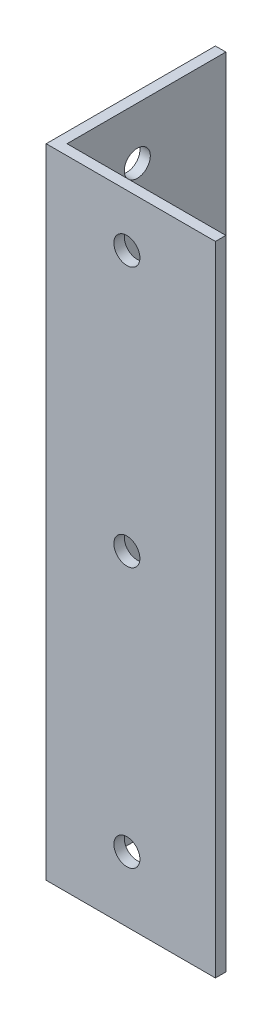
ISO-10303-21;
HEADER;
FILE_DESCRIPTION(('STEP AP214'),'2;1');
FILE_NAME('part.step','',(''),(''),'','','');
FILE_SCHEMA(('AUTOMOTIVE_DESIGN { 1 0 10303 214 1 1 1 1 }'));
ENDSEC;
DATA;
#1=APPLICATION_CONTEXT('core data for automotive mechanical design processes');
#2=APPLICATION_PROTOCOL_DEFINITION('international standard','automotive_design',2000,#1);
#3=PRODUCT_CONTEXT('',#1,'mechanical');
#4=PRODUCT('Part','Part','',(#3));
#5=PRODUCT_RELATED_PRODUCT_CATEGORY('part','',(#4));
#6=PRODUCT_DEFINITION_FORMATION('','',#4);
#7=PRODUCT_DEFINITION_CONTEXT('part definition',#1,'design');
#8=PRODUCT_DEFINITION('design','',#6,#7);
#9=PRODUCT_DEFINITION_SHAPE('','',#8);
#10=(LENGTH_UNIT() NAMED_UNIT(*) SI_UNIT(.MILLI.,.METRE.));
#11=(NAMED_UNIT(*) PLANE_ANGLE_UNIT() SI_UNIT($,.RADIAN.));
#12=(NAMED_UNIT(*) SI_UNIT($,.STERADIAN.) SOLID_ANGLE_UNIT());
#13=UNCERTAINTY_MEASURE_WITH_UNIT(LENGTH_MEASURE(1.E-05),#10,'distance_accuracy_value','');
#14=(GEOMETRIC_REPRESENTATION_CONTEXT(3) GLOBAL_UNCERTAINTY_ASSIGNED_CONTEXT((#13)) GLOBAL_UNIT_ASSIGNED_CONTEXT((#10,
#11,#12)) REPRESENTATION_CONTEXT('',''));
#15=CARTESIAN_POINT('',(0.,0.,0.));
#16=DIRECTION('',(0.,0.,1.));
#17=DIRECTION('',(1.,0.,0.));
#18=AXIS2_PLACEMENT_3D('',#15,#16,#17);
#19=CARTESIAN_POINT('',(4.,245.,0.));
#20=DIRECTION('',(-1.,0.,0.));
#21=DIRECTION('',(0.,0.,1.));
#22=AXIS2_PLACEMENT_3D('',#19,#20,#21);
#23=PLANE('',#22);
#24=CARTESIAN_POINT('',(4.,125.,-30.9999999999961));
#25=DIRECTION('',(-1.,0.,0.));
#26=DIRECTION('',(0.,0.,1.));
#27=AXIS2_PLACEMENT_3D('',#24,#25,#26);
#28=CIRCLE('',#27,4.99999999999999);
#29=CARTESIAN_POINT('',(4.,125.,-25.9999999999961));
#30=VERTEX_POINT('',#29);
#31=EDGE_CURVE('E223',#30,#30,#28,.T.);
#32=ORIENTED_EDGE('',*,*,#31,.T.);
#33=EDGE_LOOP('',(#32));
#34=FACE_BOUND('',#33,.T.);
#35=CARTESIAN_POINT('',(4.,25.,-30.9999999999922));
#36=DIRECTION('',(-1.,0.,0.));
#37=DIRECTION('',(0.,0.,1.));
#38=AXIS2_PLACEMENT_3D('',#35,#36,#37);
#39=CIRCLE('',#38,5.);
#40=CARTESIAN_POINT('',(4.,25.,-25.9999999999922));
#41=VERTEX_POINT('',#40);
#42=EDGE_CURVE('E225',#41,#41,#39,.T.);
#43=ORIENTED_EDGE('',*,*,#42,.T.);
#44=EDGE_LOOP('',(#43));
#45=FACE_BOUND('',#44,.T.);
#46=CARTESIAN_POINT('',(4.,225.,-31.));
#47=DIRECTION('',(-1.,0.,0.));
#48=DIRECTION('',(0.,0.,1.));
#49=AXIS2_PLACEMENT_3D('',#46,#47,#48);
#50=CIRCLE('',#49,5.);
#51=CARTESIAN_POINT('',(4.,225.,-26.));
#52=VERTEX_POINT('',#51);
#53=EDGE_CURVE('E142',#52,#52,#50,.T.);
#54=ORIENTED_EDGE('',*,*,#53,.T.);
#55=EDGE_LOOP('',(#54));
#56=FACE_BOUND('',#55,.T.);
#57=DIRECTION('',(0.,0.,-1.));
#58=VECTOR('',#57,1.);
#59=CARTESIAN_POINT('',(4.,0.,0.));
#60=LINE('',#59,#58);
#61=CARTESIAN_POINT('',(4.,0.,-4.));
#62=VERTEX_POINT('',#61);
#63=CARTESIAN_POINT('',(4.,0.,-65.));
#64=VERTEX_POINT('',#63);
#65=EDGE_CURVE('E128',#62,#64,#60,.T.);
#66=ORIENTED_EDGE('',*,*,#65,.T.);
#67=DIRECTION('',(0.,-1.,0.));
#68=VECTOR('',#67,1.);
#69=CARTESIAN_POINT('',(4.,245.,-65.));
#70=LINE('',#69,#68);
#71=CARTESIAN_POINT('',(4.,245.,-65.));
#72=VERTEX_POINT('',#71);
#73=EDGE_CURVE('E11',#72,#64,#70,.T.);
#74=ORIENTED_EDGE('',*,*,#73,.F.);
#75=DIRECTION('',(0.,0.,-1.));
#76=VECTOR('',#75,1.);
#77=CARTESIAN_POINT('',(4.,245.,0.));
#78=LINE('',#77,#76);
#79=CARTESIAN_POINT('',(4.,245.,-4.));
#80=VERTEX_POINT('',#79);
#81=EDGE_CURVE('E149',#80,#72,#78,.T.);
#82=ORIENTED_EDGE('',*,*,#81,.F.);
#83=DIRECTION('',(0.,-1.,0.));
#84=VECTOR('',#83,1.);
#85=CARTESIAN_POINT('',(4.,245.,-4.));
#86=LINE('',#85,#84);
#87=EDGE_CURVE('E120',#80,#62,#86,.T.);
#88=ORIENTED_EDGE('',*,*,#87,.T.);
#89=EDGE_LOOP('',(#66,#74,#82,#88));
#90=FACE_BOUND('',#89,.T.);
#91=ADVANCED_FACE('F37',(#34,#45,#56,#90),#23,.F.);
#92=CARTESIAN_POINT('',(0.,245.,-65.));
#93=DIRECTION('',(0.,0.,-1.));
#94=DIRECTION('',(-1.,0.,0.));
#95=AXIS2_PLACEMENT_3D('',#92,#93,#94);
#96=PLANE('',#95);
#97=DIRECTION('',(1.,0.,0.));
#98=VECTOR('',#97,1.);
#99=CARTESIAN_POINT('',(0.,0.,-65.));
#100=LINE('',#99,#98);
#101=CARTESIAN_POINT('',(0.,0.,-65.));
#102=VERTEX_POINT('',#101);
#103=EDGE_CURVE('E156',#102,#64,#100,.T.);
#104=ORIENTED_EDGE('',*,*,#103,.F.);
#105=DIRECTION('',(0.,-1.,0.));
#106=VECTOR('',#105,1.);
#107=CARTESIAN_POINT('',(0.,245.,-65.));
#108=LINE('',#107,#106);
#109=CARTESIAN_POINT('',(0.,245.,-65.));
#110=VERTEX_POINT('',#109);
#111=EDGE_CURVE('E46',#110,#102,#108,.T.);
#112=ORIENTED_EDGE('',*,*,#111,.F.);
#113=DIRECTION('',(1.,0.,0.));
#114=VECTOR('',#113,1.);
#115=CARTESIAN_POINT('',(0.,245.,-65.));
#116=LINE('',#115,#114);
#117=EDGE_CURVE('E88',#110,#72,#116,.T.);
#118=ORIENTED_EDGE('',*,*,#117,.T.);
#119=ORIENTED_EDGE('',*,*,#73,.T.);
#120=EDGE_LOOP('',(#104,#112,#118,#119));
#121=FACE_BOUND('',#120,.T.);
#122=ADVANCED_FACE('F169',(#121),#96,.T.);
#123=CARTESIAN_POINT('',(0.,245.,0.));
#124=DIRECTION('',(-1.,0.,0.));
#125=DIRECTION('',(0.,0.,1.));
#126=AXIS2_PLACEMENT_3D('',#123,#124,#125);
#127=PLANE('',#126);
#128=CARTESIAN_POINT('',(0.,125.,-30.9999999999961));
#129=DIRECTION('',(-1.,0.,0.));
#130=DIRECTION('',(0.,0.,1.));
#131=AXIS2_PLACEMENT_3D('',#128,#129,#130);
#132=CIRCLE('',#131,4.99999999999999);
#133=CARTESIAN_POINT('',(0.,125.,-25.9999999999961));
#134=VERTEX_POINT('',#133);
#135=EDGE_CURVE('E220',#134,#134,#132,.T.);
#136=ORIENTED_EDGE('',*,*,#135,.F.);
#137=EDGE_LOOP('',(#136));
#138=FACE_BOUND('',#137,.T.);
#139=CARTESIAN_POINT('',(0.,25.,-30.9999999999922));
#140=DIRECTION('',(-1.,0.,0.));
#141=DIRECTION('',(0.,0.,1.));
#142=AXIS2_PLACEMENT_3D('',#139,#140,#141);
#143=CIRCLE('',#142,5.);
#144=CARTESIAN_POINT('',(0.,25.,-25.9999999999922));
#145=VERTEX_POINT('',#144);
#146=EDGE_CURVE('E231',#145,#145,#143,.T.);
#147=ORIENTED_EDGE('',*,*,#146,.F.);
#148=EDGE_LOOP('',(#147));
#149=FACE_BOUND('',#148,.T.);
#150=CARTESIAN_POINT('',(0.,225.,-31.));
#151=DIRECTION('',(-1.,0.,0.));
#152=DIRECTION('',(0.,0.,1.));
#153=AXIS2_PLACEMENT_3D('',#150,#151,#152);
#154=CIRCLE('',#153,5.);
#155=CARTESIAN_POINT('',(0.,225.,-26.));
#156=VERTEX_POINT('',#155);
#157=EDGE_CURVE('E224',#156,#156,#154,.T.);
#158=ORIENTED_EDGE('',*,*,#157,.F.);
#159=EDGE_LOOP('',(#158));
#160=FACE_BOUND('',#159,.T.);
#161=DIRECTION('',(0.,0.,-1.));
#162=VECTOR('',#161,1.);
#163=CARTESIAN_POINT('',(0.,0.,0.));
#164=LINE('',#163,#162);
#165=CARTESIAN_POINT('',(0.,0.,0.));
#166=VERTEX_POINT('',#165);
#167=EDGE_CURVE('E158',#166,#102,#164,.T.);
#168=ORIENTED_EDGE('',*,*,#167,.F.);
#169=DIRECTION('',(0.,-1.,0.));
#170=VECTOR('',#169,1.);
#171=CARTESIAN_POINT('',(0.,245.,0.));
#172=LINE('',#171,#170);
#173=CARTESIAN_POINT('',(0.,245.,0.));
#174=VERTEX_POINT('',#173);
#175=EDGE_CURVE('E117',#174,#166,#172,.T.);
#176=ORIENTED_EDGE('',*,*,#175,.F.);
#177=DIRECTION('',(0.,0.,-1.));
#178=VECTOR('',#177,1.);
#179=CARTESIAN_POINT('',(0.,245.,0.));
#180=LINE('',#179,#178);
#181=EDGE_CURVE('E110',#174,#110,#180,.T.);
#182=ORIENTED_EDGE('',*,*,#181,.T.);
#183=ORIENTED_EDGE('',*,*,#111,.T.);
#184=EDGE_LOOP('',(#168,#176,#182,#183));
#185=FACE_BOUND('',#184,.T.);
#186=ADVANCED_FACE('F171',(#138,#149,#160,#185),#127,.T.);
#187=CARTESIAN_POINT('',(0.,245.,0.));
#188=DIRECTION('',(0.,0.,1.));
#189=DIRECTION('',(1.,0.,0.));
#190=AXIS2_PLACEMENT_3D('',#187,#188,#189);
#191=PLANE('',#190);
#192=CARTESIAN_POINT('',(31.0000000000039,125.,0.));
#193=DIRECTION('',(0.,0.,1.));
#194=DIRECTION('',(1.,0.,0.));
#195=AXIS2_PLACEMENT_3D('',#192,#193,#194);
#196=CIRCLE('',#195,5.00000000000001);
#197=CARTESIAN_POINT('',(36.0000000000039,125.,0.));
#198=VERTEX_POINT('',#197);
#199=EDGE_CURVE('E132',#198,#198,#196,.T.);
#200=ORIENTED_EDGE('',*,*,#199,.F.);
#201=EDGE_LOOP('',(#200));
#202=FACE_BOUND('',#201,.T.);
#203=CARTESIAN_POINT('',(31.0000000000078,25.,0.));
#204=DIRECTION('',(0.,0.,1.));
#205=DIRECTION('',(1.,0.,0.));
#206=AXIS2_PLACEMENT_3D('',#203,#204,#205);
#207=CIRCLE('',#206,5.);
#208=CARTESIAN_POINT('',(36.0000000000078,25.,0.));
#209=VERTEX_POINT('',#208);
#210=EDGE_CURVE('E137',#209,#209,#207,.T.);
#211=ORIENTED_EDGE('',*,*,#210,.F.);
#212=EDGE_LOOP('',(#211));
#213=FACE_BOUND('',#212,.T.);
#214=CARTESIAN_POINT('',(31.,225.,0.));
#215=DIRECTION('',(0.,0.,1.));
#216=DIRECTION('',(1.,0.,0.));
#217=AXIS2_PLACEMENT_3D('',#214,#215,#216);
#218=CIRCLE('',#217,5.);
#219=CARTESIAN_POINT('',(36.,225.,0.));
#220=VERTEX_POINT('',#219);
#221=EDGE_CURVE('E129',#220,#220,#218,.T.);
#222=ORIENTED_EDGE('',*,*,#221,.F.);
#223=EDGE_LOOP('',(#222));
#224=FACE_BOUND('',#223,.T.);
#225=DIRECTION('',(-1.,0.,0.));
#226=VECTOR('',#225,1.);
#227=CARTESIAN_POINT('',(0.,0.,0.));
#228=LINE('',#227,#226);
#229=CARTESIAN_POINT('',(65.,0.,0.));
#230=VERTEX_POINT('',#229);
#231=EDGE_CURVE('E116',#230,#166,#228,.T.);
#232=ORIENTED_EDGE('',*,*,#231,.F.);
#233=DIRECTION('',(0.,-1.,0.));
#234=VECTOR('',#233,1.);
#235=CARTESIAN_POINT('',(65.,245.,0.));
#236=LINE('',#235,#234);
#237=CARTESIAN_POINT('',(65.,245.,0.));
#238=VERTEX_POINT('',#237);
#239=EDGE_CURVE('E103',#238,#230,#236,.T.);
#240=ORIENTED_EDGE('',*,*,#239,.F.);
#241=DIRECTION('',(-1.,0.,0.));
#242=VECTOR('',#241,1.);
#243=CARTESIAN_POINT('',(0.,245.,0.));
#244=LINE('',#243,#242);
#245=EDGE_CURVE('E106',#238,#174,#244,.T.);
#246=ORIENTED_EDGE('',*,*,#245,.T.);
#247=ORIENTED_EDGE('',*,*,#175,.T.);
#248=EDGE_LOOP('',(#232,#240,#246,#247));
#249=FACE_BOUND('',#248,.T.);
#250=ADVANCED_FACE('F115',(#202,#213,#224,#249),#191,.T.);
#251=CARTESIAN_POINT('',(65.,245.,-4.));
#252=DIRECTION('',(1.,0.,0.));
#253=DIRECTION('',(0.,0.,-1.));
#254=AXIS2_PLACEMENT_3D('',#251,#252,#253);
#255=PLANE('',#254);
#256=DIRECTION('',(0.,0.,1.));
#257=VECTOR('',#256,1.);
#258=CARTESIAN_POINT('',(65.,0.,-4.));
#259=LINE('',#258,#257);
#260=CARTESIAN_POINT('',(65.,0.,-4.));
#261=VERTEX_POINT('',#260);
#262=EDGE_CURVE('E161',#261,#230,#259,.T.);
#263=ORIENTED_EDGE('',*,*,#262,.F.);
#264=DIRECTION('',(0.,-1.,0.));
#265=VECTOR('',#264,1.);
#266=CARTESIAN_POINT('',(65.,245.,-4.));
#267=LINE('',#266,#265);
#268=CARTESIAN_POINT('',(65.,245.,-4.));
#269=VERTEX_POINT('',#268);
#270=EDGE_CURVE('E105',#269,#261,#267,.T.);
#271=ORIENTED_EDGE('',*,*,#270,.F.);
#272=DIRECTION('',(0.,0.,1.));
#273=VECTOR('',#272,1.);
#274=CARTESIAN_POINT('',(65.,245.,-4.));
#275=LINE('',#274,#273);
#276=EDGE_CURVE('E98',#269,#238,#275,.T.);
#277=ORIENTED_EDGE('',*,*,#276,.T.);
#278=ORIENTED_EDGE('',*,*,#239,.T.);
#279=EDGE_LOOP('',(#263,#271,#277,#278));
#280=FACE_BOUND('',#279,.T.);
#281=ADVANCED_FACE('F101',(#280),#255,.T.);
#282=CARTESIAN_POINT('',(0.,245.,-4.));
#283=DIRECTION('',(0.,0.,1.));
#284=DIRECTION('',(1.,0.,0.));
#285=AXIS2_PLACEMENT_3D('',#282,#283,#284);
#286=PLANE('',#285);
#287=CARTESIAN_POINT('',(31.0000000000039,125.,-4.));
#288=DIRECTION('',(0.,0.,1.));
#289=DIRECTION('',(1.,0.,0.));
#290=AXIS2_PLACEMENT_3D('',#287,#288,#289);
#291=CIRCLE('',#290,5.00000000000001);
#292=CARTESIAN_POINT('',(36.0000000000039,125.,-4.));
#293=VERTEX_POINT('',#292);
#294=EDGE_CURVE('E40',#293,#293,#291,.T.);
#295=ORIENTED_EDGE('',*,*,#294,.T.);
#296=EDGE_LOOP('',(#295));
#297=FACE_BOUND('',#296,.T.);
#298=CARTESIAN_POINT('',(31.0000000000078,25.,-4.));
#299=DIRECTION('',(0.,0.,1.));
#300=DIRECTION('',(1.,0.,0.));
#301=AXIS2_PLACEMENT_3D('',#298,#299,#300);
#302=CIRCLE('',#301,5.);
#303=CARTESIAN_POINT('',(36.0000000000078,25.,-4.));
#304=VERTEX_POINT('',#303);
#305=EDGE_CURVE('E130',#304,#304,#302,.T.);
#306=ORIENTED_EDGE('',*,*,#305,.T.);
#307=EDGE_LOOP('',(#306));
#308=FACE_BOUND('',#307,.T.);
#309=CARTESIAN_POINT('',(31.,225.,-4.));
#310=DIRECTION('',(0.,0.,1.));
#311=DIRECTION('',(1.,0.,0.));
#312=AXIS2_PLACEMENT_3D('',#309,#310,#311);
#313=CIRCLE('',#312,5.);
#314=CARTESIAN_POINT('',(36.,225.,-4.));
#315=VERTEX_POINT('',#314);
#316=EDGE_CURVE('E126',#315,#315,#313,.T.);
#317=ORIENTED_EDGE('',*,*,#316,.T.);
#318=EDGE_LOOP('',(#317));
#319=FACE_BOUND('',#318,.T.);
#320=DIRECTION('',(1.,0.,0.));
#321=VECTOR('',#320,1.);
#322=CARTESIAN_POINT('',(0.,0.,-4.));
#323=LINE('',#322,#321);
#324=EDGE_CURVE('E77',#261,#62,#323,.F.);
#325=ORIENTED_EDGE('',*,*,#324,.T.);
#326=ORIENTED_EDGE('',*,*,#87,.F.);
#327=DIRECTION('',(1.,0.,0.));
#328=VECTOR('',#327,1.);
#329=CARTESIAN_POINT('',(0.,245.,-4.));
#330=LINE('',#329,#328);
#331=EDGE_CURVE('E55',#269,#80,#330,.F.);
#332=ORIENTED_EDGE('',*,*,#331,.F.);
#333=ORIENTED_EDGE('',*,*,#270,.T.);
#334=EDGE_LOOP('',(#325,#326,#332,#333));
#335=FACE_BOUND('',#334,.T.);
#336=ADVANCED_FACE('F185',(#297,#308,#319,#335),#286,.F.);
#337=CARTESIAN_POINT('',(0.,245.,0.));
#338=DIRECTION('',(0.,-1.,0.));
#339=DIRECTION('',(-1.,0.,0.));
#340=AXIS2_PLACEMENT_3D('',#337,#338,#339);
#341=PLANE('',#340);
#342=ORIENTED_EDGE('',*,*,#81,.T.);
#343=ORIENTED_EDGE('',*,*,#117,.F.);
#344=ORIENTED_EDGE('',*,*,#181,.F.);
#345=ORIENTED_EDGE('',*,*,#245,.F.);
#346=ORIENTED_EDGE('',*,*,#276,.F.);
#347=ORIENTED_EDGE('',*,*,#331,.T.);
#348=EDGE_LOOP('',(#342,#343,#344,#345,#346,#347));
#349=FACE_BOUND('',#348,.T.);
#350=ADVANCED_FACE('F109',(#349),#341,.F.);
#351=CARTESIAN_POINT('',(0.,0.,0.));
#352=DIRECTION('',(0.,-1.,0.));
#353=DIRECTION('',(-1.,0.,0.));
#354=AXIS2_PLACEMENT_3D('',#351,#352,#353);
#355=PLANE('',#354);
#356=ORIENTED_EDGE('',*,*,#65,.F.);
#357=ORIENTED_EDGE('',*,*,#324,.F.);
#358=ORIENTED_EDGE('',*,*,#262,.T.);
#359=ORIENTED_EDGE('',*,*,#231,.T.);
#360=ORIENTED_EDGE('',*,*,#167,.T.);
#361=ORIENTED_EDGE('',*,*,#103,.T.);
#362=EDGE_LOOP('',(#356,#357,#358,#359,#360,#361));
#363=FACE_BOUND('',#362,.T.);
#364=ADVANCED_FACE('F166',(#363),#355,.T.);
#365=CARTESIAN_POINT('',(31.,225.,-10.));
#366=DIRECTION('',(0.,0.,1.));
#367=DIRECTION('',(1.,0.,0.));
#368=AXIS2_PLACEMENT_3D('',#365,#366,#367);
#369=CYLINDRICAL_SURFACE('',#368,5.);
#370=ORIENTED_EDGE('',*,*,#221,.T.);
#371=EDGE_LOOP('',(#370));
#372=FACE_BOUND('',#371,.T.);
#373=ORIENTED_EDGE('',*,*,#316,.F.);
#374=EDGE_LOOP('',(#373));
#375=FACE_BOUND('',#374,.T.);
#376=ADVANCED_FACE('F191',(#372,#375),#369,.F.);
#377=CARTESIAN_POINT('',(31.0000000000078,25.,-10.));
#378=DIRECTION('',(0.,0.,1.));
#379=DIRECTION('',(1.,0.,0.));
#380=AXIS2_PLACEMENT_3D('',#377,#378,#379);
#381=CYLINDRICAL_SURFACE('',#380,5.);
#382=ORIENTED_EDGE('',*,*,#210,.T.);
#383=EDGE_LOOP('',(#382));
#384=FACE_BOUND('',#383,.T.);
#385=ORIENTED_EDGE('',*,*,#305,.F.);
#386=EDGE_LOOP('',(#385));
#387=FACE_BOUND('',#386,.T.);
#388=ADVANCED_FACE('F196',(#384,#387),#381,.F.);
#389=CARTESIAN_POINT('',(31.0000000000039,125.,-10.));
#390=DIRECTION('',(0.,0.,1.));
#391=DIRECTION('',(1.,0.,0.));
#392=AXIS2_PLACEMENT_3D('',#389,#390,#391);
#393=CYLINDRICAL_SURFACE('',#392,5.00000000000001);
#394=ORIENTED_EDGE('',*,*,#199,.T.);
#395=EDGE_LOOP('',(#394));
#396=FACE_BOUND('',#395,.T.);
#397=ORIENTED_EDGE('',*,*,#294,.F.);
#398=EDGE_LOOP('',(#397));
#399=FACE_BOUND('',#398,.T.);
#400=ADVANCED_FACE('F200',(#396,#399),#393,.F.);
#401=CARTESIAN_POINT('',(10.,225.,-31.));
#402=DIRECTION('',(-1.,0.,0.));
#403=DIRECTION('',(0.,0.,1.));
#404=AXIS2_PLACEMENT_3D('',#401,#402,#403);
#405=CYLINDRICAL_SURFACE('',#404,5.);
#406=ORIENTED_EDGE('',*,*,#157,.T.);
#407=EDGE_LOOP('',(#406));
#408=FACE_BOUND('',#407,.T.);
#409=ORIENTED_EDGE('',*,*,#53,.F.);
#410=EDGE_LOOP('',(#409));
#411=FACE_BOUND('',#410,.T.);
#412=ADVANCED_FACE('F204',(#408,#411),#405,.F.);
#413=CARTESIAN_POINT('',(10.,25.,-30.9999999999922));
#414=DIRECTION('',(-1.,0.,0.));
#415=DIRECTION('',(0.,0.,1.));
#416=AXIS2_PLACEMENT_3D('',#413,#414,#415);
#417=CYLINDRICAL_SURFACE('',#416,5.);
#418=ORIENTED_EDGE('',*,*,#146,.T.);
#419=EDGE_LOOP('',(#418));
#420=FACE_BOUND('',#419,.T.);
#421=ORIENTED_EDGE('',*,*,#42,.F.);
#422=EDGE_LOOP('',(#421));
#423=FACE_BOUND('',#422,.T.);
#424=ADVANCED_FACE('F207',(#420,#423),#417,.F.);
#425=CARTESIAN_POINT('',(10.,125.,-30.9999999999961));
#426=DIRECTION('',(-1.,0.,0.));
#427=DIRECTION('',(0.,0.,1.));
#428=AXIS2_PLACEMENT_3D('',#425,#426,#427);
#429=CYLINDRICAL_SURFACE('',#428,4.99999999999999);
#430=ORIENTED_EDGE('',*,*,#135,.T.);
#431=EDGE_LOOP('',(#430));
#432=FACE_BOUND('',#431,.T.);
#433=ORIENTED_EDGE('',*,*,#31,.F.);
#434=EDGE_LOOP('',(#433));
#435=FACE_BOUND('',#434,.T.);
#436=ADVANCED_FACE('F211',(#432,#435),#429,.F.);
#437=CLOSED_SHELL('',(#91,#122,#186,#250,#281,#336,#350,#364,#376,#388,#400,#412,#424,#436));
#438=MANIFOLD_SOLID_BREP('B2',#437);
#439=ADVANCED_BREP_SHAPE_REPRESENTATION('',(#18,#438),#14);
#440=SHAPE_DEFINITION_REPRESENTATION(#9,#439);
ENDSEC;
END-ISO-10303-21;
